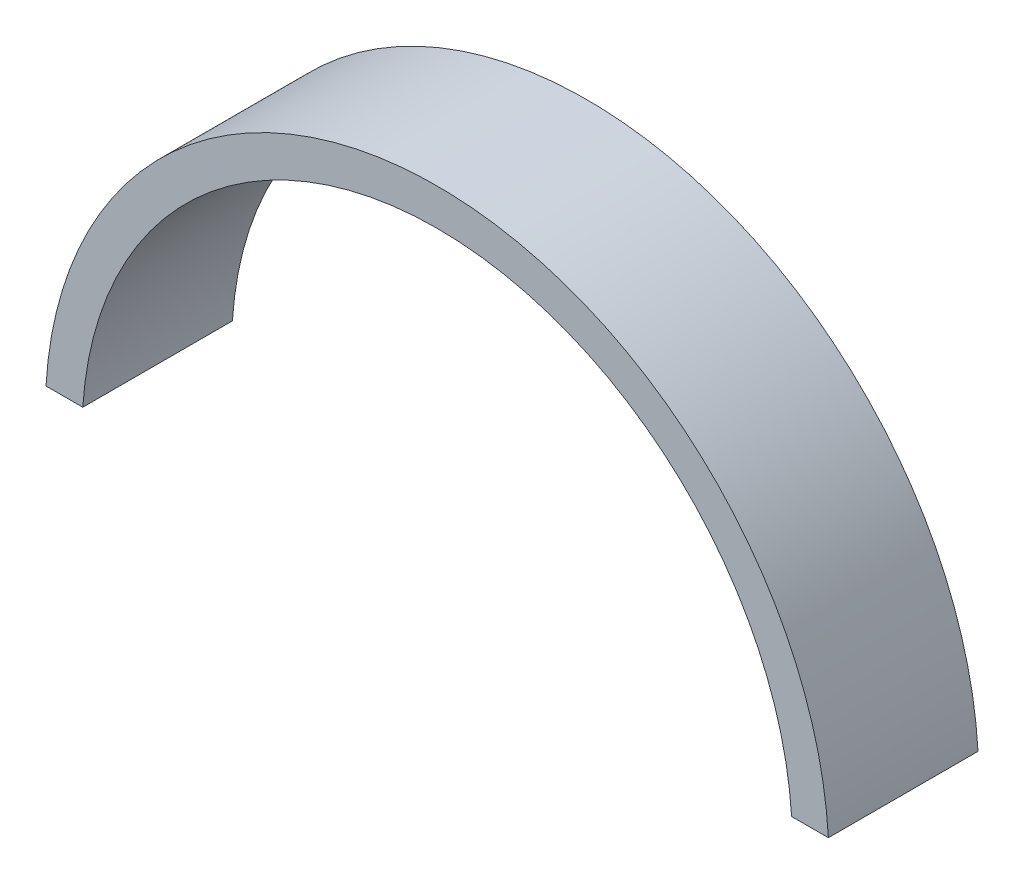
ISO-10303-21;
HEADER;
FILE_DESCRIPTION(('STEP AP214'),'2;1');
FILE_NAME('part.step','',(''),(''),'','','');
FILE_SCHEMA(('AUTOMOTIVE_DESIGN { 1 0 10303 214 1 1 1 1 }'));
ENDSEC;
DATA;
#1=APPLICATION_CONTEXT('core data for automotive mechanical design processes');
#2=APPLICATION_PROTOCOL_DEFINITION('international standard','automotive_design',2000,#1);
#3=PRODUCT_CONTEXT('',#1,'mechanical');
#4=PRODUCT('Part','Part','',(#3));
#5=PRODUCT_RELATED_PRODUCT_CATEGORY('part','',(#4));
#6=PRODUCT_DEFINITION_FORMATION('','',#4);
#7=PRODUCT_DEFINITION_CONTEXT('part definition',#1,'design');
#8=PRODUCT_DEFINITION('design','',#6,#7);
#9=PRODUCT_DEFINITION_SHAPE('','',#8);
#10=(LENGTH_UNIT() NAMED_UNIT(*) SI_UNIT(.MILLI.,.METRE.));
#11=(NAMED_UNIT(*) PLANE_ANGLE_UNIT() SI_UNIT($,.RADIAN.));
#12=(NAMED_UNIT(*) SI_UNIT($,.STERADIAN.) SOLID_ANGLE_UNIT());
#13=UNCERTAINTY_MEASURE_WITH_UNIT(LENGTH_MEASURE(1.E-05),#10,'distance_accuracy_value','');
#14=(GEOMETRIC_REPRESENTATION_CONTEXT(3) GLOBAL_UNCERTAINTY_ASSIGNED_CONTEXT((#13)) GLOBAL_UNIT_ASSIGNED_CONTEXT((#10,
#11,#12)) REPRESENTATION_CONTEXT('',''));
#15=CARTESIAN_POINT('',(0.,0.,0.));
#16=DIRECTION('',(0.,0.,1.));
#17=DIRECTION('',(1.,0.,0.));
#18=AXIS2_PLACEMENT_3D('',#15,#16,#17);
#19=CARTESIAN_POINT('',(0.,4.61076413342446,30.));
#20=DIRECTION('',(0.,1.,0.));
#21=DIRECTION('',(0.,0.,1.));
#22=AXIS2_PLACEMENT_3D('',#19,#20,#21);
#23=PLANE('',#22);
#24=DIRECTION('',(1.,0.,0.));
#25=VECTOR('',#24,1.);
#26=CARTESIAN_POINT('',(0.,4.61076413342446,0.));
#27=LINE('',#26,#25);
#28=CARTESIAN_POINT('',(71.0625299745735,4.61076413342446,0.));
#29=VERTEX_POINT('',#28);
#30=CARTESIAN_POINT('',(78.4380119498518,4.61076413342446,0.));
#31=VERTEX_POINT('',#30);
#32=EDGE_CURVE('E98',#29,#31,#27,.T.);
#33=ORIENTED_EDGE('',*,*,#32,.T.);
#34=DIRECTION('',(0.,0.,-1.));
#35=VECTOR('',#34,1.);
#36=CARTESIAN_POINT('',(78.4380119498518,4.61076413342446,30.));
#37=LINE('',#36,#35);
#38=CARTESIAN_POINT('',(78.4380119498518,4.61076413342446,30.));
#39=VERTEX_POINT('',#38);
#40=EDGE_CURVE('E11',#39,#31,#37,.T.);
#41=ORIENTED_EDGE('',*,*,#40,.F.);
#42=DIRECTION('',(1.,0.,0.));
#43=VECTOR('',#42,1.);
#44=CARTESIAN_POINT('',(0.,4.61076413342446,30.));
#45=LINE('',#44,#43);
#46=CARTESIAN_POINT('',(71.0625299745735,4.61076413342446,30.));
#47=VERTEX_POINT('',#46);
#48=EDGE_CURVE('E84',#47,#39,#45,.T.);
#49=ORIENTED_EDGE('',*,*,#48,.F.);
#50=DIRECTION('',(0.,0.,-1.));
#51=VECTOR('',#50,1.);
#52=CARTESIAN_POINT('',(71.0625299745735,4.61076413342446,30.));
#53=LINE('',#52,#51);
#54=EDGE_CURVE('E51',#47,#29,#53,.T.);
#55=ORIENTED_EDGE('',*,*,#54,.T.);
#56=EDGE_LOOP('',(#33,#41,#49,#55));
#57=FACE_BOUND('',#56,.T.);
#58=ADVANCED_FACE('F35',(#57),#23,.F.);
#59=CARTESIAN_POINT('',(0.,0.,30.));
#60=DIRECTION('',(0.,0.,-1.));
#61=DIRECTION('',(-1.,0.,0.));
#62=AXIS2_PLACEMENT_3D('',#59,#60,#61);
#63=CYLINDRICAL_SURFACE('',#62,78.5734106714171);
#64=CARTESIAN_POINT('',(0.,0.,0.));
#65=DIRECTION('',(0.,0.,1.));
#66=DIRECTION('',(1.,0.,0.));
#67=AXIS2_PLACEMENT_3D('',#64,#65,#66);
#68=CIRCLE('',#67,78.5734106714171);
#69=CARTESIAN_POINT('',(-78.4380119498518,4.61076413342446,0.));
#70=VERTEX_POINT('',#69);
#71=EDGE_CURVE('E89',#31,#70,#68,.T.);
#72=ORIENTED_EDGE('',*,*,#71,.T.);
#73=DIRECTION('',(0.,0.,-1.));
#74=VECTOR('',#73,1.);
#75=CARTESIAN_POINT('',(-78.4380119498518,4.61076413342446,30.));
#76=LINE('',#75,#74);
#77=CARTESIAN_POINT('',(-78.4380119498518,4.61076413342446,30.));
#78=VERTEX_POINT('',#77);
#79=EDGE_CURVE('E43',#78,#70,#76,.T.);
#80=ORIENTED_EDGE('',*,*,#79,.F.);
#81=CARTESIAN_POINT('',(0.,0.,30.));
#82=DIRECTION('',(0.,0.,1.));
#83=DIRECTION('',(1.,0.,0.));
#84=AXIS2_PLACEMENT_3D('',#81,#82,#83);
#85=CIRCLE('',#84,78.5734106714171);
#86=EDGE_CURVE('E77',#39,#78,#85,.T.);
#87=ORIENTED_EDGE('',*,*,#86,.F.);
#88=ORIENTED_EDGE('',*,*,#40,.T.);
#89=EDGE_LOOP('',(#72,#80,#87,#88));
#90=FACE_BOUND('',#89,.T.);
#91=ADVANCED_FACE('F88',(#90),#63,.T.);
#92=CARTESIAN_POINT('',(0.,4.61076413342446,30.));
#93=DIRECTION('',(0.,1.,0.));
#94=DIRECTION('',(0.,0.,1.));
#95=AXIS2_PLACEMENT_3D('',#92,#93,#94);
#96=PLANE('',#95);
#97=DIRECTION('',(1.,0.,0.));
#98=VECTOR('',#97,1.);
#99=CARTESIAN_POINT('',(0.,4.61076413342446,0.));
#100=LINE('',#99,#98);
#101=CARTESIAN_POINT('',(-71.0625299745735,4.61076413342446,0.));
#102=VERTEX_POINT('',#101);
#103=EDGE_CURVE('E101',#70,#102,#100,.T.);
#104=ORIENTED_EDGE('',*,*,#103,.T.);
#105=DIRECTION('',(0.,0.,-1.));
#106=VECTOR('',#105,1.);
#107=CARTESIAN_POINT('',(-71.0625299745735,4.61076413342446,30.));
#108=LINE('',#107,#106);
#109=CARTESIAN_POINT('',(-71.0625299745735,4.61076413342446,30.));
#110=VERTEX_POINT('',#109);
#111=EDGE_CURVE('E66',#110,#102,#108,.T.);
#112=ORIENTED_EDGE('',*,*,#111,.F.);
#113=DIRECTION('',(1.,0.,0.));
#114=VECTOR('',#113,1.);
#115=CARTESIAN_POINT('',(0.,4.61076413342446,30.));
#116=LINE('',#115,#114);
#117=EDGE_CURVE('E83',#78,#110,#116,.T.);
#118=ORIENTED_EDGE('',*,*,#117,.F.);
#119=ORIENTED_EDGE('',*,*,#79,.T.);
#120=EDGE_LOOP('',(#104,#112,#118,#119));
#121=FACE_BOUND('',#120,.T.);
#122=ADVANCED_FACE('F92',(#121),#96,.F.);
#123=CARTESIAN_POINT('',(0.,0.,30.));
#124=DIRECTION('',(0.,0.,-1.));
#125=DIRECTION('',(-1.,0.,0.));
#126=AXIS2_PLACEMENT_3D('',#123,#124,#125);
#127=CYLINDRICAL_SURFACE('',#126,71.2119534367737);
#128=CARTESIAN_POINT('',(0.,0.,0.));
#129=DIRECTION('',(0.,0.,1.));
#130=DIRECTION('',(1.,0.,0.));
#131=AXIS2_PLACEMENT_3D('',#128,#129,#130);
#132=CIRCLE('',#131,71.2119534367737);
#133=EDGE_CURVE('E103',#29,#102,#132,.T.);
#134=ORIENTED_EDGE('',*,*,#133,.F.);
#135=ORIENTED_EDGE('',*,*,#54,.F.);
#136=CARTESIAN_POINT('',(0.,0.,30.));
#137=DIRECTION('',(0.,0.,1.));
#138=DIRECTION('',(1.,0.,0.));
#139=AXIS2_PLACEMENT_3D('',#136,#137,#138);
#140=CIRCLE('',#139,71.2119534367737);
#141=EDGE_CURVE('E93',#47,#110,#140,.T.);
#142=ORIENTED_EDGE('',*,*,#141,.T.);
#143=ORIENTED_EDGE('',*,*,#111,.T.);
#144=EDGE_LOOP('',(#134,#135,#142,#143));
#145=FACE_BOUND('',#144,.T.);
#146=ADVANCED_FACE('F109',(#145),#127,.F.);
#147=CARTESIAN_POINT('',(0.,0.,30.));
#148=DIRECTION('',(0.,0.,1.));
#149=DIRECTION('',(1.,0.,0.));
#150=AXIS2_PLACEMENT_3D('',#147,#148,#149);
#151=PLANE('',#150);
#152=ORIENTED_EDGE('',*,*,#48,.T.);
#153=ORIENTED_EDGE('',*,*,#86,.T.);
#154=ORIENTED_EDGE('',*,*,#117,.T.);
#155=ORIENTED_EDGE('',*,*,#141,.F.);
#156=EDGE_LOOP('',(#152,#153,#154,#155));
#157=FACE_BOUND('',#156,.T.);
#158=ADVANCED_FACE('F80',(#157),#151,.T.);
#159=CARTESIAN_POINT('',(0.,0.,0.));
#160=DIRECTION('',(0.,0.,1.));
#161=DIRECTION('',(1.,0.,0.));
#162=AXIS2_PLACEMENT_3D('',#159,#160,#161);
#163=PLANE('',#162);
#164=ORIENTED_EDGE('',*,*,#32,.F.);
#165=ORIENTED_EDGE('',*,*,#133,.T.);
#166=ORIENTED_EDGE('',*,*,#103,.F.);
#167=ORIENTED_EDGE('',*,*,#71,.F.);
#168=EDGE_LOOP('',(#164,#165,#166,#167));
#169=FACE_BOUND('',#168,.T.);
#170=ADVANCED_FACE('F108',(#169),#163,.F.);
#171=CLOSED_SHELL('',(#58,#91,#122,#146,#158,#170));
#172=MANIFOLD_SOLID_BREP('B2',#171);
#173=ADVANCED_BREP_SHAPE_REPRESENTATION('',(#18,#172),#14);
#174=SHAPE_DEFINITION_REPRESENTATION(#9,#173);
ENDSEC;
END-ISO-10303-21;
